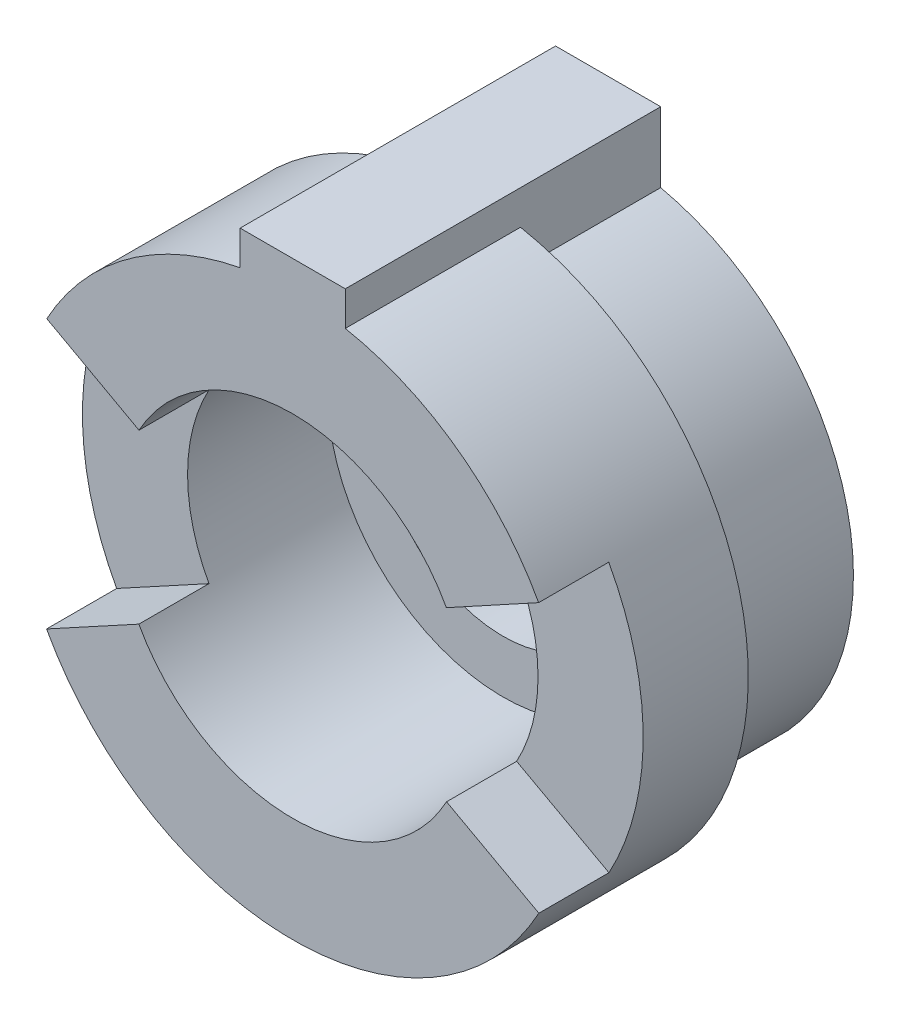
ISO-10303-21;
HEADER;
FILE_DESCRIPTION(('STEP AP214'),'2;1');
FILE_NAME('part.step','',(''),(''),'','','');
FILE_SCHEMA(('AUTOMOTIVE_DESIGN { 1 0 10303 214 1 1 1 1 }'));
ENDSEC;
DATA;
#1=APPLICATION_CONTEXT('core data for automotive mechanical design processes');
#2=APPLICATION_PROTOCOL_DEFINITION('international standard','automotive_design',2000,#1);
#3=PRODUCT_CONTEXT('',#1,'mechanical');
#4=PRODUCT('Part','Part','',(#3));
#5=PRODUCT_RELATED_PRODUCT_CATEGORY('part','',(#4));
#6=PRODUCT_DEFINITION_FORMATION('','',#4);
#7=PRODUCT_DEFINITION_CONTEXT('part definition',#1,'design');
#8=PRODUCT_DEFINITION('design','',#6,#7);
#9=PRODUCT_DEFINITION_SHAPE('','',#8);
#10=(LENGTH_UNIT() NAMED_UNIT(*) SI_UNIT(.MILLI.,.METRE.));
#11=(NAMED_UNIT(*) PLANE_ANGLE_UNIT() SI_UNIT($,.RADIAN.));
#12=(NAMED_UNIT(*) SI_UNIT($,.STERADIAN.) SOLID_ANGLE_UNIT());
#13=UNCERTAINTY_MEASURE_WITH_UNIT(LENGTH_MEASURE(1.E-05),#10,'distance_accuracy_value','');
#14=(GEOMETRIC_REPRESENTATION_CONTEXT(3) GLOBAL_UNCERTAINTY_ASSIGNED_CONTEXT((#13)) GLOBAL_UNIT_ASSIGNED_CONTEXT((#10,
#11,#12)) REPRESENTATION_CONTEXT('',''));
#15=CARTESIAN_POINT('',(0.,0.,0.));
#16=DIRECTION('',(0.,0.,1.));
#17=DIRECTION('',(1.,0.,0.));
#18=AXIS2_PLACEMENT_3D('',#15,#16,#17);
#19=CARTESIAN_POINT('',(0.,0.,9.));
#20=DIRECTION('',(0.,0.,1.));
#21=DIRECTION('',(1.,0.,0.));
#22=AXIS2_PLACEMENT_3D('',#19,#20,#21);
#23=PLANE('',#22);
#24=DIRECTION('',(-0.877200504274681,0.480124229028535,0.));
#25=VECTOR('',#24,1.);
#26=CARTESIAN_POINT('',(-7.01760403419745,3.84099383222828,9.));
#27=LINE('',#26,#25);
#28=CARTESIAN_POINT('',(-4.38600252137341,2.40062114514268,9.));
#29=VERTEX_POINT('',#28);
#30=CARTESIAN_POINT('',(-7.01760403419745,3.84099383222828,9.));
#31=VERTEX_POINT('',#30);
#32=EDGE_CURVE('E238',#29,#31,#27,.T.);
#33=ORIENTED_EDGE('',*,*,#32,.F.);
#34=CARTESIAN_POINT('',(0.,0.,9.));
#35=DIRECTION('',(0.,0.,1.));
#36=DIRECTION('',(1.,0.,0.));
#37=AXIS2_PLACEMENT_3D('',#34,#35,#36);
#38=CIRCLE('',#37,5.);
#39=CARTESIAN_POINT('',(4.38600252137341,2.40062114514267,9.));
#40=VERTEX_POINT('',#39);
#41=EDGE_CURVE('E260',#40,#29,#38,.T.);
#42=ORIENTED_EDGE('',*,*,#41,.F.);
#43=DIRECTION('',(0.877200504274682,0.480124229028534,0.));
#44=VECTOR('',#43,1.);
#45=CARTESIAN_POINT('',(7.01760403419745,3.84099383222827,9.));
#46=LINE('',#45,#44);
#47=CARTESIAN_POINT('',(7.01760403419745,3.84099383222827,9.));
#48=VERTEX_POINT('',#47);
#49=EDGE_CURVE('E92',#40,#48,#46,.T.);
#50=ORIENTED_EDGE('',*,*,#49,.T.);
#51=CARTESIAN_POINT('',(0.,0.,9.));
#52=DIRECTION('',(0.,0.,1.));
#53=DIRECTION('',(1.,0.,0.));
#54=AXIS2_PLACEMENT_3D('',#51,#52,#53);
#55=CIRCLE('',#54,8.);
#56=CARTESIAN_POINT('',(1.50000000000014,7.85811682275083,9.));
#57=VERTEX_POINT('',#56);
#58=EDGE_CURVE('E190',#48,#57,#55,.T.);
#59=ORIENTED_EDGE('',*,*,#58,.T.);
#60=DIRECTION('',(0.,-1.,0.));
#61=VECTOR('',#60,1.);
#62=CARTESIAN_POINT('',(1.50000000000014,7.85811682275083,9.));
#63=LINE('',#62,#61);
#64=CARTESIAN_POINT('',(1.50000000000014,8.83739716558864,9.));
#65=VERTEX_POINT('',#64);
#66=EDGE_CURVE('E171',#65,#57,#63,.T.);
#67=ORIENTED_EDGE('',*,*,#66,.F.);
#68=DIRECTION('',(1.,0.,0.));
#69=VECTOR('',#68,1.);
#70=CARTESIAN_POINT('',(1.50000000000014,8.83739716558864,9.));
#71=LINE('',#70,#69);
#72=CARTESIAN_POINT('',(-1.50000000000014,8.83739716558864,9.));
#73=VERTEX_POINT('',#72);
#74=EDGE_CURVE('E187',#73,#65,#71,.T.);
#75=ORIENTED_EDGE('',*,*,#74,.F.);
#76=DIRECTION('',(0.,1.,0.));
#77=VECTOR('',#76,1.);
#78=CARTESIAN_POINT('',(-1.50000000000014,8.83739716558864,9.));
#79=LINE('',#78,#77);
#80=CARTESIAN_POINT('',(-1.50000000000014,7.85811682275083,9.));
#81=VERTEX_POINT('',#80);
#82=EDGE_CURVE('E180',#81,#73,#79,.T.);
#83=ORIENTED_EDGE('',*,*,#82,.F.);
#84=EDGE_CURVE('E266',#81,#31,#55,.T.);
#85=ORIENTED_EDGE('',*,*,#84,.T.);
#86=EDGE_LOOP('',(#33,#42,#50,#59,#67,#75,#83,#85));
#87=FACE_BOUND('',#86,.T.);
#88=ADVANCED_FACE('F69',(#87),#23,.T.);
#89=CARTESIAN_POINT('',(0.,0.,3.));
#90=DIRECTION('',(0.,0.,1.));
#91=DIRECTION('',(1.,0.,0.));
#92=AXIS2_PLACEMENT_3D('',#89,#90,#91);
#93=PLANE('',#92);
#94=CARTESIAN_POINT('',(0.,0.,3.));
#95=DIRECTION('',(0.,0.,1.));
#96=DIRECTION('',(1.,0.,0.));
#97=AXIS2_PLACEMENT_3D('',#94,#95,#96);
#98=CIRCLE('',#97,5.);
#99=CARTESIAN_POINT('',(5.,0.,3.));
#100=VERTEX_POINT('',#99);
#101=EDGE_CURVE('E270',#100,#100,#98,.F.);
#102=ORIENTED_EDGE('',*,*,#101,.F.);
#103=EDGE_LOOP('',(#102));
#104=FACE_BOUND('',#103,.T.);
#105=CARTESIAN_POINT('',(0.,0.,3.));
#106=DIRECTION('',(0.,0.,1.));
#107=DIRECTION('',(1.,0.,0.));
#108=AXIS2_PLACEMENT_3D('',#105,#106,#107);
#109=CIRCLE('',#108,3.5);
#110=CARTESIAN_POINT('',(3.5,0.,3.));
#111=VERTEX_POINT('',#110);
#112=EDGE_CURVE('E267',#111,#111,#109,.T.);
#113=ORIENTED_EDGE('',*,*,#112,.F.);
#114=EDGE_LOOP('',(#113));
#115=FACE_BOUND('',#114,.T.);
#116=ADVANCED_FACE('F342',(#104,#115),#93,.T.);
#117=CARTESIAN_POINT('',(0.,0.,0.));
#118=DIRECTION('',(0.,0.,1.));
#119=DIRECTION('',(1.,0.,0.));
#120=AXIS2_PLACEMENT_3D('',#117,#118,#119);
#121=PLANE('',#120);
#122=DIRECTION('',(0.,-1.,0.));
#123=VECTOR('',#122,1.);
#124=CARTESIAN_POINT('',(-1.50000000000009,7.85811682275084,0.));
#125=LINE('',#124,#123);
#126=CARTESIAN_POINT('',(-1.50000000000014,8.83739716558864,0.));
#127=VERTEX_POINT('',#126);
#128=CARTESIAN_POINT('',(-1.50000000000009,6.83739716558865,0.));
#129=VERTEX_POINT('',#128);
#130=EDGE_CURVE('E201',#127,#129,#125,.T.);
#131=ORIENTED_EDGE('',*,*,#130,.F.);
#132=DIRECTION('',(1.,0.,0.));
#133=VECTOR('',#132,1.);
#134=CARTESIAN_POINT('',(1.50000000000014,8.83739716558864,0.));
#135=LINE('',#134,#133);
#136=CARTESIAN_POINT('',(1.50000000000014,8.83739716558864,0.));
#137=VERTEX_POINT('',#136);
#138=EDGE_CURVE('E195',#127,#137,#135,.T.);
#139=ORIENTED_EDGE('',*,*,#138,.T.);
#140=DIRECTION('',(0.,1.,0.));
#141=VECTOR('',#140,1.);
#142=CARTESIAN_POINT('',(1.50000000000014,6.83739716558865,0.));
#143=LINE('',#142,#141);
#144=CARTESIAN_POINT('',(1.50000000000014,6.83739716558865,0.));
#145=VERTEX_POINT('',#144);
#146=EDGE_CURVE('E174',#145,#137,#143,.T.);
#147=ORIENTED_EDGE('',*,*,#146,.F.);
#148=CARTESIAN_POINT('',(0.,0.,0.));
#149=DIRECTION('',(0.,0.,1.));
#150=DIRECTION('',(-1.,0.,0.));
#151=AXIS2_PLACEMENT_3D('',#148,#149,#150);
#152=CIRCLE('',#151,7.00000000000001);
#153=EDGE_CURVE('E220',#129,#145,#152,.T.);
#154=ORIENTED_EDGE('',*,*,#153,.F.);
#155=EDGE_LOOP('',(#131,#139,#147,#154));
#156=FACE_BOUND('',#155,.T.);
#157=CARTESIAN_POINT('',(0.,0.,0.));
#158=DIRECTION('',(0.,0.,1.));
#159=DIRECTION('',(1.,0.,0.));
#160=AXIS2_PLACEMENT_3D('',#157,#158,#159);
#161=CIRCLE('',#160,3.5);
#162=CARTESIAN_POINT('',(3.5,0.,0.));
#163=VERTEX_POINT('',#162);
#164=EDGE_CURVE('E265',#163,#163,#161,.T.);
#165=ORIENTED_EDGE('',*,*,#164,.T.);
#166=EDGE_LOOP('',(#165));
#167=FACE_BOUND('',#166,.T.);
#168=ADVANCED_FACE('F328',(#156,#167),#121,.F.);
#169=CARTESIAN_POINT('',(0.,0.,3.));
#170=DIRECTION('',(0.,0.,-1.));
#171=DIRECTION('',(-1.,0.,0.));
#172=AXIS2_PLACEMENT_3D('',#169,#170,#171);
#173=CYLINDRICAL_SURFACE('',#172,8.);
#174=ORIENTED_EDGE('',*,*,#84,.F.);
#175=DIRECTION('',(0.,0.,-1.));
#176=VECTOR('',#175,1.);
#177=CARTESIAN_POINT('',(-1.50000000000014,7.85811682275083,9.));
#178=LINE('',#177,#176);
#179=CARTESIAN_POINT('',(-1.50000000000014,7.85811682275083,4.));
#180=VERTEX_POINT('',#179);
#181=EDGE_CURVE('E202',#81,#180,#178,.T.);
#182=ORIENTED_EDGE('',*,*,#181,.T.);
#183=CARTESIAN_POINT('',(0.,0.,4.));
#184=DIRECTION('',(0.,0.,-1.));
#185=DIRECTION('',(-1.,0.,0.));
#186=AXIS2_PLACEMENT_3D('',#183,#184,#185);
#187=CIRCLE('',#186,8.00000000000001);
#188=CARTESIAN_POINT('',(1.50000000000014,7.85811682275083,4.));
#189=VERTEX_POINT('',#188);
#190=EDGE_CURVE('E205',#189,#180,#187,.T.);
#191=ORIENTED_EDGE('',*,*,#190,.F.);
#192=DIRECTION('',(0.,0.,-1.));
#193=VECTOR('',#192,1.);
#194=CARTESIAN_POINT('',(1.50000000000014,7.85811682275083,9.));
#195=LINE('',#194,#193);
#196=EDGE_CURVE('E179',#57,#189,#195,.T.);
#197=ORIENTED_EDGE('',*,*,#196,.F.);
#198=ORIENTED_EDGE('',*,*,#58,.F.);
#199=DIRECTION('',(0.,0.,1.));
#200=VECTOR('',#199,1.);
#201=CARTESIAN_POINT('',(7.01760403419745,3.84099383222827,7.));
#202=LINE('',#201,#200);
#203=CARTESIAN_POINT('',(7.01760403419745,3.84099383222827,7.));
#204=VERTEX_POINT('',#203);
#205=EDGE_CURVE('E246',#204,#48,#202,.T.);
#206=ORIENTED_EDGE('',*,*,#205,.F.);
#207=CARTESIAN_POINT('',(0.,0.,7.));
#208=DIRECTION('',(0.,0.,-1.));
#209=DIRECTION('',(0.877964062999077,-0.478726544158722,0.));
#210=AXIS2_PLACEMENT_3D('',#207,#208,#209);
#211=CIRCLE('',#210,8.);
#212=CARTESIAN_POINT('',(7.02371250399262,-3.82981235326977,7.));
#213=VERTEX_POINT('',#212);
#214=EDGE_CURVE('E242',#204,#213,#211,.T.);
#215=ORIENTED_EDGE('',*,*,#214,.T.);
#216=DIRECTION('',(0.,0.,-1.));
#217=VECTOR('',#216,1.);
#218=CARTESIAN_POINT('',(7.02371250399262,-3.82981235326977,9.));
#219=LINE('',#218,#217);
#220=CARTESIAN_POINT('',(7.02371250399262,-3.82981235326977,9.));
#221=VERTEX_POINT('',#220);
#222=EDGE_CURVE('E248',#221,#213,#219,.T.);
#223=ORIENTED_EDGE('',*,*,#222,.F.);
#224=CARTESIAN_POINT('',(-7.02371250399263,-3.82981235326976,9.));
#225=VERTEX_POINT('',#224);
#226=EDGE_CURVE('E263',#225,#221,#55,.T.);
#227=ORIENTED_EDGE('',*,*,#226,.F.);
#228=DIRECTION('',(0.,0.,1.));
#229=VECTOR('',#228,1.);
#230=CARTESIAN_POINT('',(-7.02371250399263,-3.82981235326976,7.));
#231=LINE('',#230,#229);
#232=CARTESIAN_POINT('',(-7.02371250399263,-3.82981235326976,7.));
#233=VERTEX_POINT('',#232);
#234=EDGE_CURVE('E230',#233,#225,#231,.T.);
#235=ORIENTED_EDGE('',*,*,#234,.F.);
#236=CARTESIAN_POINT('',(0.,0.,7.));
#237=DIRECTION('',(0.,0.,-1.));
#238=DIRECTION('',(-0.877200504274681,0.480124229028534,0.));
#239=AXIS2_PLACEMENT_3D('',#236,#237,#238);
#240=CIRCLE('',#239,8.);
#241=CARTESIAN_POINT('',(-7.01760403419745,3.84099383222828,7.));
#242=VERTEX_POINT('',#241);
#243=EDGE_CURVE('E226',#233,#242,#240,.T.);
#244=ORIENTED_EDGE('',*,*,#243,.T.);
#245=DIRECTION('',(0.,0.,-1.));
#246=VECTOR('',#245,1.);
#247=CARTESIAN_POINT('',(-7.01760403419745,3.84099383222828,9.));
#248=LINE('',#247,#246);
#249=EDGE_CURVE('E232',#31,#242,#248,.T.);
#250=ORIENTED_EDGE('',*,*,#249,.F.);
#251=EDGE_LOOP('',(#174,#182,#191,#197,#198,#206,#215,#223,#227,#235,#244,#250));
#252=FACE_BOUND('',#251,.T.);
#253=ADVANCED_FACE('F71',(#252),#173,.T.);
#254=CARTESIAN_POINT('',(0.,0.,3.));
#255=DIRECTION('',(0.,0.,-1.));
#256=DIRECTION('',(-1.,0.,0.));
#257=AXIS2_PLACEMENT_3D('',#254,#255,#256);
#258=CYLINDRICAL_SURFACE('',#257,3.5);
#259=ORIENTED_EDGE('',*,*,#112,.T.);
#260=EDGE_LOOP('',(#259));
#261=FACE_BOUND('',#260,.T.);
#262=ORIENTED_EDGE('',*,*,#164,.F.);
#263=EDGE_LOOP('',(#262));
#264=FACE_BOUND('',#263,.T.);
#265=ADVANCED_FACE('F352',(#261,#264),#258,.F.);
#266=DIRECTION('',(-0.877964062999078,-0.47872654415872,0.));
#267=VECTOR('',#266,1.);
#268=CARTESIAN_POINT('',(-7.02371250399263,-3.82981235326976,9.));
#269=LINE('',#268,#267);
#270=CARTESIAN_POINT('',(-4.38982031499539,-2.3936327207936,9.));
#271=VERTEX_POINT('',#270);
#272=EDGE_CURVE('E84',#271,#225,#269,.T.);
#273=ORIENTED_EDGE('',*,*,#272,.T.);
#274=ORIENTED_EDGE('',*,*,#226,.T.);
#275=DIRECTION('',(0.877964062999077,-0.478726544158722,0.));
#276=VECTOR('',#275,1.);
#277=CARTESIAN_POINT('',(7.02371250399262,-3.82981235326977,9.));
#278=LINE('',#277,#276);
#279=CARTESIAN_POINT('',(4.38982031499539,-2.39363272079361,9.));
#280=VERTEX_POINT('',#279);
#281=EDGE_CURVE('E254',#280,#221,#278,.T.);
#282=ORIENTED_EDGE('',*,*,#281,.F.);
#283=EDGE_CURVE('E258',#271,#280,#38,.T.);
#284=ORIENTED_EDGE('',*,*,#283,.F.);
#285=EDGE_LOOP('',(#273,#274,#282,#284));
#286=FACE_BOUND('',#285,.T.);
#287=ADVANCED_FACE('F306',(#286),#23,.T.);
#288=CARTESIAN_POINT('',(0.,0.,9.));
#289=DIRECTION('',(0.,0.,-1.));
#290=DIRECTION('',(-1.,0.,0.));
#291=AXIS2_PLACEMENT_3D('',#288,#289,#290);
#292=CYLINDRICAL_SURFACE('',#291,5.);
#293=DIRECTION('',(0.,0.,-1.));
#294=VECTOR('',#293,1.);
#295=CARTESIAN_POINT('',(-4.38600252137341,2.40062114514268,9.));
#296=LINE('',#295,#294);
#297=CARTESIAN_POINT('',(-4.38600252137341,2.40062114514268,7.));
#298=VERTEX_POINT('',#297);
#299=EDGE_CURVE('E13',#298,#29,#296,.F.);
#300=ORIENTED_EDGE('',*,*,#299,.F.);
#301=CARTESIAN_POINT('',(0.,0.,7.));
#302=DIRECTION('',(0.,0.,1.));
#303=DIRECTION('',(1.,0.,0.));
#304=AXIS2_PLACEMENT_3D('',#301,#302,#303);
#305=CIRCLE('',#304,5.);
#306=CARTESIAN_POINT('',(-4.38982031499539,-2.3936327207936,7.));
#307=VERTEX_POINT('',#306);
#308=EDGE_CURVE('E77',#307,#298,#305,.F.);
#309=ORIENTED_EDGE('',*,*,#308,.F.);
#310=DIRECTION('',(0.,0.,-1.));
#311=VECTOR('',#310,1.);
#312=CARTESIAN_POINT('',(-4.38982031499539,-2.3936327207936,9.));
#313=LINE('',#312,#311);
#314=EDGE_CURVE('E282',#271,#307,#313,.T.);
#315=ORIENTED_EDGE('',*,*,#314,.F.);
#316=ORIENTED_EDGE('',*,*,#283,.T.);
#317=DIRECTION('',(0.,0.,-1.));
#318=VECTOR('',#317,1.);
#319=CARTESIAN_POINT('',(4.38982031499539,-2.39363272079361,9.));
#320=LINE('',#319,#318);
#321=CARTESIAN_POINT('',(4.38982031499539,-2.39363272079361,7.));
#322=VERTEX_POINT('',#321);
#323=EDGE_CURVE('E279',#322,#280,#320,.F.);
#324=ORIENTED_EDGE('',*,*,#323,.F.);
#325=CARTESIAN_POINT('',(0.,0.,7.));
#326=DIRECTION('',(0.,0.,1.));
#327=DIRECTION('',(1.,0.,0.));
#328=AXIS2_PLACEMENT_3D('',#325,#326,#327);
#329=CIRCLE('',#328,5.);
#330=CARTESIAN_POINT('',(4.38600252137341,2.40062114514267,7.));
#331=VERTEX_POINT('',#330);
#332=EDGE_CURVE('E277',#331,#322,#329,.F.);
#333=ORIENTED_EDGE('',*,*,#332,.F.);
#334=DIRECTION('',(0.,0.,-1.));
#335=VECTOR('',#334,1.);
#336=CARTESIAN_POINT('',(4.38600252137341,2.40062114514267,9.));
#337=LINE('',#336,#335);
#338=EDGE_CURVE('E275',#40,#331,#337,.T.);
#339=ORIENTED_EDGE('',*,*,#338,.F.);
#340=ORIENTED_EDGE('',*,*,#41,.T.);
#341=EDGE_LOOP('',(#300,#309,#315,#316,#324,#333,#339,#340));
#342=FACE_BOUND('',#341,.T.);
#343=ORIENTED_EDGE('',*,*,#101,.T.);
#344=EDGE_LOOP('',(#343));
#345=FACE_BOUND('',#344,.T.);
#346=ADVANCED_FACE('F294',(#342,#345),#292,.F.);
#347=CARTESIAN_POINT('',(7.02371250399262,-3.82981235326977,8.));
#348=DIRECTION('',(-0.478726544158722,-0.877964062999077,0.));
#349=DIRECTION('',(0.,0.,-1.));
#350=AXIS2_PLACEMENT_3D('',#347,#348,#349);
#351=PLANE('',#350);
#352=ORIENTED_EDGE('',*,*,#323,.T.);
#353=ORIENTED_EDGE('',*,*,#281,.T.);
#354=ORIENTED_EDGE('',*,*,#222,.T.);
#355=DIRECTION('',(0.877964062999077,-0.478726544158722,0.));
#356=VECTOR('',#355,1.);
#357=CARTESIAN_POINT('',(7.02371250399262,-3.82981235326977,7.));
#358=LINE('',#357,#356);
#359=EDGE_CURVE('E252',#322,#213,#358,.T.);
#360=ORIENTED_EDGE('',*,*,#359,.F.);
#361=EDGE_LOOP('',(#352,#353,#354,#360));
#362=FACE_BOUND('',#361,.T.);
#363=ADVANCED_FACE('F311',(#362),#351,.F.);
#364=CARTESIAN_POINT('',(0.,0.,7.));
#365=DIRECTION('',(0.,0.,1.));
#366=DIRECTION('',(1.,0.,0.));
#367=AXIS2_PLACEMENT_3D('',#364,#365,#366);
#368=PLANE('',#367);
#369=ORIENTED_EDGE('',*,*,#332,.T.);
#370=ORIENTED_EDGE('',*,*,#359,.T.);
#371=ORIENTED_EDGE('',*,*,#214,.F.);
#372=DIRECTION('',(0.877200504274682,0.480124229028534,0.));
#373=VECTOR('',#372,1.);
#374=CARTESIAN_POINT('',(7.01760403419745,3.84099383222827,7.));
#375=LINE('',#374,#373);
#376=EDGE_CURVE('E251',#331,#204,#375,.T.);
#377=ORIENTED_EDGE('',*,*,#376,.F.);
#378=EDGE_LOOP('',(#369,#370,#371,#377));
#379=FACE_BOUND('',#378,.T.);
#380=ADVANCED_FACE('F314',(#379),#368,.T.);
#381=CARTESIAN_POINT('',(7.01760403419745,3.84099383222827,8.));
#382=DIRECTION('',(-0.480124229028534,0.877200504274682,0.));
#383=DIRECTION('',(0.,0.,1.));
#384=AXIS2_PLACEMENT_3D('',#381,#382,#383);
#385=PLANE('',#384);
#386=ORIENTED_EDGE('',*,*,#338,.T.);
#387=ORIENTED_EDGE('',*,*,#376,.T.);
#388=ORIENTED_EDGE('',*,*,#205,.T.);
#389=ORIENTED_EDGE('',*,*,#49,.F.);
#390=EDGE_LOOP('',(#386,#387,#388,#389));
#391=FACE_BOUND('',#390,.T.);
#392=ADVANCED_FACE('F317',(#391),#385,.F.);
#393=CARTESIAN_POINT('',(-7.01760403419745,3.84099383222828,8.));
#394=DIRECTION('',(0.480124229028535,0.877200504274681,0.));
#395=DIRECTION('',(0.,0.,-1.));
#396=AXIS2_PLACEMENT_3D('',#393,#394,#395);
#397=PLANE('',#396);
#398=ORIENTED_EDGE('',*,*,#299,.T.);
#399=ORIENTED_EDGE('',*,*,#32,.T.);
#400=ORIENTED_EDGE('',*,*,#249,.T.);
#401=DIRECTION('',(-0.877200504274681,0.480124229028535,0.));
#402=VECTOR('',#401,1.);
#403=CARTESIAN_POINT('',(-7.01760403419745,3.84099383222828,7.));
#404=LINE('',#403,#402);
#405=EDGE_CURVE('E236',#298,#242,#404,.T.);
#406=ORIENTED_EDGE('',*,*,#405,.F.);
#407=EDGE_LOOP('',(#398,#399,#400,#406));
#408=FACE_BOUND('',#407,.T.);
#409=ADVANCED_FACE('F292',(#408),#397,.F.);
#410=CARTESIAN_POINT('',(0.,0.,7.));
#411=DIRECTION('',(0.,0.,1.));
#412=DIRECTION('',(1.,0.,0.));
#413=AXIS2_PLACEMENT_3D('',#410,#411,#412);
#414=PLANE('',#413);
#415=ORIENTED_EDGE('',*,*,#308,.T.);
#416=ORIENTED_EDGE('',*,*,#405,.T.);
#417=ORIENTED_EDGE('',*,*,#243,.F.);
#418=DIRECTION('',(-0.877964062999078,-0.47872654415872,0.));
#419=VECTOR('',#418,1.);
#420=CARTESIAN_POINT('',(-7.02371250399263,-3.82981235326976,7.));
#421=LINE('',#420,#419);
#422=EDGE_CURVE('E235',#307,#233,#421,.T.);
#423=ORIENTED_EDGE('',*,*,#422,.F.);
#424=EDGE_LOOP('',(#415,#416,#417,#423));
#425=FACE_BOUND('',#424,.T.);
#426=ADVANCED_FACE('F287',(#425),#414,.T.);
#427=CARTESIAN_POINT('',(-7.02371250399263,-3.82981235326976,8.));
#428=DIRECTION('',(0.47872654415872,-0.877964062999078,0.));
#429=DIRECTION('',(0.,0.,1.));
#430=AXIS2_PLACEMENT_3D('',#427,#428,#429);
#431=PLANE('',#430);
#432=ORIENTED_EDGE('',*,*,#314,.T.);
#433=ORIENTED_EDGE('',*,*,#422,.T.);
#434=ORIENTED_EDGE('',*,*,#234,.T.);
#435=ORIENTED_EDGE('',*,*,#272,.F.);
#436=EDGE_LOOP('',(#432,#433,#434,#435));
#437=FACE_BOUND('',#436,.T.);
#438=ADVANCED_FACE('F303',(#437),#431,.F.);
#439=CARTESIAN_POINT('',(1.50000000000014,6.83739716558865,4.));
#440=DIRECTION('',(-1.,0.,0.));
#441=DIRECTION('',(0.,0.,1.));
#442=AXIS2_PLACEMENT_3D('',#439,#440,#441);
#443=PLANE('',#442);
#444=ORIENTED_EDGE('',*,*,#146,.T.);
#445=DIRECTION('',(0.,0.,-1.));
#446=VECTOR('',#445,1.);
#447=CARTESIAN_POINT('',(1.50000000000014,8.83739716558864,9.));
#448=LINE('',#447,#446);
#449=EDGE_CURVE('E168',#65,#137,#448,.T.);
#450=ORIENTED_EDGE('',*,*,#449,.F.);
#451=ORIENTED_EDGE('',*,*,#66,.T.);
#452=ORIENTED_EDGE('',*,*,#196,.T.);
#453=DIRECTION('',(0.,1.,0.));
#454=VECTOR('',#453,1.);
#455=CARTESIAN_POINT('',(1.50000000000014,6.83739716558865,4.));
#456=LINE('',#455,#454);
#457=CARTESIAN_POINT('',(1.50000000000014,6.83739716558865,4.));
#458=VERTEX_POINT('',#457);
#459=EDGE_CURVE('E214',#458,#189,#456,.T.);
#460=ORIENTED_EDGE('',*,*,#459,.F.);
#461=DIRECTION('',(0.,0.,-1.));
#462=VECTOR('',#461,1.);
#463=CARTESIAN_POINT('',(1.50000000000014,6.83739716558865,4.));
#464=LINE('',#463,#462);
#465=EDGE_CURVE('E224',#458,#145,#464,.T.);
#466=ORIENTED_EDGE('',*,*,#465,.T.);
#467=EDGE_LOOP('',(#444,#450,#451,#452,#460,#466));
#468=FACE_BOUND('',#467,.T.);
#469=ADVANCED_FACE('F170',(#468),#443,.F.);
#470=CARTESIAN_POINT('',(0.,0.,4.));
#471=DIRECTION('',(0.,0.,-1.));
#472=DIRECTION('',(-1.,0.,0.));
#473=AXIS2_PLACEMENT_3D('',#470,#471,#472);
#474=CYLINDRICAL_SURFACE('',#473,7.00000000000001);
#475=ORIENTED_EDGE('',*,*,#153,.T.);
#476=ORIENTED_EDGE('',*,*,#465,.F.);
#477=CARTESIAN_POINT('',(0.,0.,4.));
#478=DIRECTION('',(0.,0.,1.));
#479=DIRECTION('',(-1.,0.,0.));
#480=AXIS2_PLACEMENT_3D('',#477,#478,#479);
#481=CIRCLE('',#480,7.00000000000001);
#482=CARTESIAN_POINT('',(-1.50000000000009,6.83739716558865,4.));
#483=VERTEX_POINT('',#482);
#484=EDGE_CURVE('E211',#483,#458,#481,.T.);
#485=ORIENTED_EDGE('',*,*,#484,.F.);
#486=DIRECTION('',(0.,0.,-1.));
#487=VECTOR('',#486,1.);
#488=CARTESIAN_POINT('',(-1.50000000000009,6.83739716558865,4.));
#489=LINE('',#488,#487);
#490=EDGE_CURVE('E217',#483,#129,#489,.T.);
#491=ORIENTED_EDGE('',*,*,#490,.T.);
#492=EDGE_LOOP('',(#475,#476,#485,#491));
#493=FACE_BOUND('',#492,.T.);
#494=ADVANCED_FACE('F325',(#493),#474,.T.);
#495=CARTESIAN_POINT('',(-1.50000000000009,7.85811682275084,4.));
#496=DIRECTION('',(1.,0.,0.));
#497=DIRECTION('',(0.,0.,-1.));
#498=AXIS2_PLACEMENT_3D('',#495,#496,#497);
#499=PLANE('',#498);
#500=ORIENTED_EDGE('',*,*,#130,.T.);
#501=ORIENTED_EDGE('',*,*,#490,.F.);
#502=DIRECTION('',(0.,-1.,0.));
#503=VECTOR('',#502,1.);
#504=CARTESIAN_POINT('',(-1.50000000000009,7.85811682275084,4.));
#505=LINE('',#504,#503);
#506=EDGE_CURVE('E208',#180,#483,#505,.T.);
#507=ORIENTED_EDGE('',*,*,#506,.F.);
#508=ORIENTED_EDGE('',*,*,#181,.F.);
#509=ORIENTED_EDGE('',*,*,#82,.T.);
#510=DIRECTION('',(0.,0.,-1.));
#511=VECTOR('',#510,1.);
#512=CARTESIAN_POINT('',(-1.50000000000014,8.83739716558864,9.));
#513=LINE('',#512,#511);
#514=EDGE_CURVE('E194',#73,#127,#513,.T.);
#515=ORIENTED_EDGE('',*,*,#514,.T.);
#516=EDGE_LOOP('',(#500,#501,#507,#508,#509,#515));
#517=FACE_BOUND('',#516,.T.);
#518=ADVANCED_FACE('F331',(#517),#499,.F.);
#519=CARTESIAN_POINT('',(0.,0.,4.));
#520=DIRECTION('',(0.,0.,-1.));
#521=DIRECTION('',(-1.,0.,0.));
#522=AXIS2_PLACEMENT_3D('',#519,#520,#521);
#523=PLANE('',#522);
#524=ORIENTED_EDGE('',*,*,#190,.T.);
#525=ORIENTED_EDGE('',*,*,#506,.T.);
#526=ORIENTED_EDGE('',*,*,#484,.T.);
#527=ORIENTED_EDGE('',*,*,#459,.T.);
#528=EDGE_LOOP('',(#524,#525,#526,#527));
#529=FACE_BOUND('',#528,.T.);
#530=ADVANCED_FACE('F321',(#529),#523,.T.);
#531=CARTESIAN_POINT('',(1.50000000000014,8.83739716558864,9.));
#532=DIRECTION('',(0.,1.,0.));
#533=DIRECTION('',(0.,0.,1.));
#534=AXIS2_PLACEMENT_3D('',#531,#532,#533);
#535=PLANE('',#534);
#536=ORIENTED_EDGE('',*,*,#138,.F.);
#537=ORIENTED_EDGE('',*,*,#514,.F.);
#538=ORIENTED_EDGE('',*,*,#74,.T.);
#539=ORIENTED_EDGE('',*,*,#449,.T.);
#540=EDGE_LOOP('',(#536,#537,#538,#539));
#541=FACE_BOUND('',#540,.T.);
#542=ADVANCED_FACE('F192',(#541),#535,.T.);
#543=CLOSED_SHELL('',(#88,#116,#168,#253,#265,#287,#346,#363,#380,#392,#409,#426,#438,#469,#494,
#518,#530,#542));
#544=MANIFOLD_SOLID_BREP('B2',#543);
#545=ADVANCED_BREP_SHAPE_REPRESENTATION('',(#18,#544),#14);
#546=SHAPE_DEFINITION_REPRESENTATION(#9,#545);
ENDSEC;
END-ISO-10303-21;
